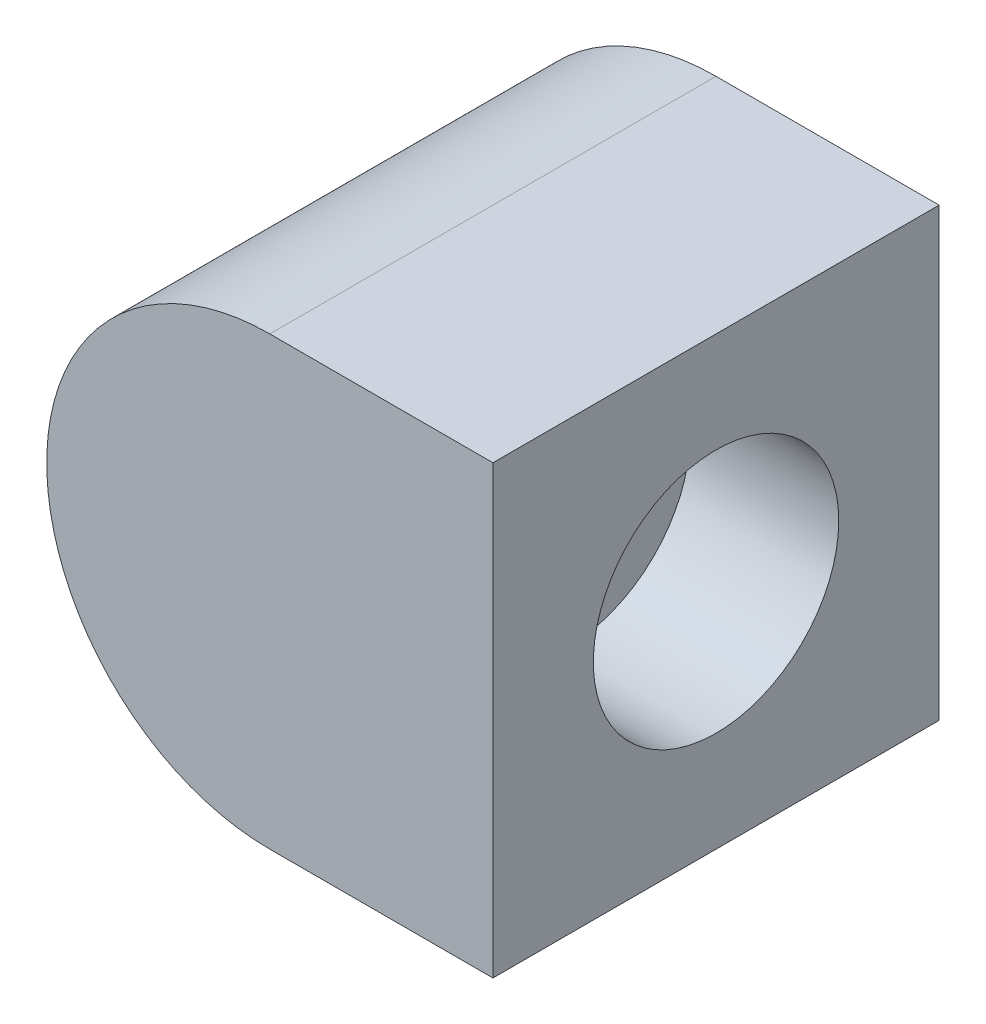
ISO-10303-21;
HEADER;
FILE_DESCRIPTION(('STEP AP214'),'2;1');
FILE_NAME('part.step','',(''),(''),'','','');
FILE_SCHEMA(('AUTOMOTIVE_DESIGN { 1 0 10303 214 1 1 1 1 }'));
ENDSEC;
DATA;
#1=APPLICATION_CONTEXT('core data for automotive mechanical design processes');
#2=APPLICATION_PROTOCOL_DEFINITION('international standard','automotive_design',2000,#1);
#3=PRODUCT_CONTEXT('',#1,'mechanical');
#4=PRODUCT('Part','Part','',(#3));
#5=PRODUCT_RELATED_PRODUCT_CATEGORY('part','',(#4));
#6=PRODUCT_DEFINITION_FORMATION('','',#4);
#7=PRODUCT_DEFINITION_CONTEXT('part definition',#1,'design');
#8=PRODUCT_DEFINITION('design','',#6,#7);
#9=PRODUCT_DEFINITION_SHAPE('','',#8);
#10=(LENGTH_UNIT() NAMED_UNIT(*) SI_UNIT(.MILLI.,.METRE.));
#11=(NAMED_UNIT(*) PLANE_ANGLE_UNIT() SI_UNIT($,.RADIAN.));
#12=(NAMED_UNIT(*) SI_UNIT($,.STERADIAN.) SOLID_ANGLE_UNIT());
#13=UNCERTAINTY_MEASURE_WITH_UNIT(LENGTH_MEASURE(1.E-05),#10,'distance_accuracy_value','');
#14=(GEOMETRIC_REPRESENTATION_CONTEXT(3) GLOBAL_UNCERTAINTY_ASSIGNED_CONTEXT((#13)) GLOBAL_UNIT_ASSIGNED_CONTEXT((#10,
#11,#12)) REPRESENTATION_CONTEXT('',''));
#15=CARTESIAN_POINT('',(0.,0.,0.));
#16=DIRECTION('',(0.,0.,1.));
#17=DIRECTION('',(1.,0.,0.));
#18=AXIS2_PLACEMENT_3D('',#15,#16,#17);
#19=CARTESIAN_POINT('',(0.,0.,6.));
#20=DIRECTION('',(0.,0.,-1.));
#21=DIRECTION('',(-1.,0.,0.));
#22=AXIS2_PLACEMENT_3D('',#19,#20,#21);
#23=CYLINDRICAL_SURFACE('',#22,3.);
#24=CARTESIAN_POINT('',(0.,0.,0.));
#25=DIRECTION('',(0.,0.,1.));
#26=DIRECTION('',(1.,0.,0.));
#27=AXIS2_PLACEMENT_3D('',#24,#25,#26);
#28=CIRCLE('',#27,3.);
#29=CARTESIAN_POINT('',(0.,3.,0.));
#30=VERTEX_POINT('',#29);
#31=CARTESIAN_POINT('',(0.,-3.,0.));
#32=VERTEX_POINT('',#31);
#33=EDGE_CURVE('E96',#30,#32,#28,.T.);
#34=ORIENTED_EDGE('',*,*,#33,.T.);
#35=DIRECTION('',(0.,0.,-1.));
#36=VECTOR('',#35,1.);
#37=CARTESIAN_POINT('',(0.,-3.,6.));
#38=LINE('',#37,#36);
#39=CARTESIAN_POINT('',(0.,-3.,6.));
#40=VERTEX_POINT('',#39);
#41=EDGE_CURVE('E11',#40,#32,#38,.T.);
#42=ORIENTED_EDGE('',*,*,#41,.F.);
#43=CARTESIAN_POINT('',(0.,0.,6.));
#44=DIRECTION('',(0.,0.,1.));
#45=DIRECTION('',(1.,0.,0.));
#46=AXIS2_PLACEMENT_3D('',#43,#44,#45);
#47=CIRCLE('',#46,3.);
#48=CARTESIAN_POINT('',(0.,3.,6.));
#49=VERTEX_POINT('',#48);
#50=EDGE_CURVE('E84',#49,#40,#47,.T.);
#51=ORIENTED_EDGE('',*,*,#50,.F.);
#52=DIRECTION('',(0.,0.,-1.));
#53=VECTOR('',#52,1.);
#54=CARTESIAN_POINT('',(0.,3.,6.));
#55=LINE('',#54,#53);
#56=EDGE_CURVE('E92',#49,#30,#55,.T.);
#57=ORIENTED_EDGE('',*,*,#56,.T.);
#58=EDGE_LOOP('',(#34,#42,#51,#57));
#59=FACE_BOUND('',#58,.T.);
#60=ADVANCED_FACE('F33',(#59),#23,.T.);
#61=CARTESIAN_POINT('',(3.,-3.,6.));
#62=DIRECTION('',(0.,1.,0.));
#63=DIRECTION('',(-1.,0.,0.));
#64=AXIS2_PLACEMENT_3D('',#61,#62,#63);
#65=PLANE('',#64);
#66=DIRECTION('',(1.,0.,0.));
#67=VECTOR('',#66,1.);
#68=CARTESIAN_POINT('',(3.,-3.,0.));
#69=LINE('',#68,#67);
#70=CARTESIAN_POINT('',(3.,-3.,0.));
#71=VERTEX_POINT('',#70);
#72=EDGE_CURVE('E88',#32,#71,#69,.T.);
#73=ORIENTED_EDGE('',*,*,#72,.T.);
#74=DIRECTION('',(0.,0.,-1.));
#75=VECTOR('',#74,1.);
#76=CARTESIAN_POINT('',(3.,-3.,6.));
#77=LINE('',#76,#75);
#78=CARTESIAN_POINT('',(3.,-3.,6.));
#79=VERTEX_POINT('',#78);
#80=EDGE_CURVE('E41',#79,#71,#77,.T.);
#81=ORIENTED_EDGE('',*,*,#80,.F.);
#82=DIRECTION('',(1.,0.,0.));
#83=VECTOR('',#82,1.);
#84=CARTESIAN_POINT('',(3.,-3.,6.));
#85=LINE('',#84,#83);
#86=EDGE_CURVE('E79',#40,#79,#85,.T.);
#87=ORIENTED_EDGE('',*,*,#86,.F.);
#88=ORIENTED_EDGE('',*,*,#41,.T.);
#89=EDGE_LOOP('',(#73,#81,#87,#88));
#90=FACE_BOUND('',#89,.T.);
#91=ADVANCED_FACE('F87',(#90),#65,.F.);
#92=CARTESIAN_POINT('',(3.,3.,6.));
#93=DIRECTION('',(-1.,0.,0.));
#94=DIRECTION('',(0.,0.,1.));
#95=AXIS2_PLACEMENT_3D('',#92,#93,#94);
#96=PLANE('',#95);
#97=CARTESIAN_POINT('',(3.,0.,3.));
#98=DIRECTION('',(1.,0.,0.));
#99=DIRECTION('',(0.,0.,-1.));
#100=AXIS2_PLACEMENT_3D('',#97,#98,#99);
#101=CIRCLE('',#100,1.65);
#102=CARTESIAN_POINT('',(3.,0.,1.35));
#103=VERTEX_POINT('',#102);
#104=EDGE_CURVE('E110',#103,#103,#101,.T.);
#105=ORIENTED_EDGE('',*,*,#104,.F.);
#106=EDGE_LOOP('',(#105));
#107=FACE_BOUND('',#106,.T.);
#108=DIRECTION('',(0.,1.,0.));
#109=VECTOR('',#108,1.);
#110=CARTESIAN_POINT('',(3.,3.,0.));
#111=LINE('',#110,#109);
#112=CARTESIAN_POINT('',(3.,3.,0.));
#113=VERTEX_POINT('',#112);
#114=EDGE_CURVE('E66',#71,#113,#111,.T.);
#115=ORIENTED_EDGE('',*,*,#114,.T.);
#116=DIRECTION('',(0.,0.,-1.));
#117=VECTOR('',#116,1.);
#118=CARTESIAN_POINT('',(3.,3.,6.));
#119=LINE('',#118,#117);
#120=CARTESIAN_POINT('',(3.,3.,6.));
#121=VERTEX_POINT('',#120);
#122=EDGE_CURVE('E89',#121,#113,#119,.T.);
#123=ORIENTED_EDGE('',*,*,#122,.F.);
#124=DIRECTION('',(0.,1.,0.));
#125=VECTOR('',#124,1.);
#126=CARTESIAN_POINT('',(3.,3.,6.));
#127=LINE('',#126,#125);
#128=EDGE_CURVE('E82',#79,#121,#127,.T.);
#129=ORIENTED_EDGE('',*,*,#128,.F.);
#130=ORIENTED_EDGE('',*,*,#80,.T.);
#131=EDGE_LOOP('',(#115,#123,#129,#130));
#132=FACE_BOUND('',#131,.T.);
#133=ADVANCED_FACE('F90',(#107,#132),#96,.F.);
#134=CARTESIAN_POINT('',(0.,3.,6.));
#135=DIRECTION('',(0.,-1.,0.));
#136=DIRECTION('',(1.,0.,0.));
#137=AXIS2_PLACEMENT_3D('',#134,#135,#136);
#138=PLANE('',#137);
#139=DIRECTION('',(-1.,0.,0.));
#140=VECTOR('',#139,1.);
#141=CARTESIAN_POINT('',(0.,3.,0.));
#142=LINE('',#141,#140);
#143=EDGE_CURVE('E72',#113,#30,#142,.T.);
#144=ORIENTED_EDGE('',*,*,#143,.T.);
#145=ORIENTED_EDGE('',*,*,#56,.F.);
#146=DIRECTION('',(-1.,0.,0.));
#147=VECTOR('',#146,1.);
#148=CARTESIAN_POINT('',(0.,3.,6.));
#149=LINE('',#148,#147);
#150=EDGE_CURVE('E49',#121,#49,#149,.T.);
#151=ORIENTED_EDGE('',*,*,#150,.F.);
#152=ORIENTED_EDGE('',*,*,#122,.T.);
#153=EDGE_LOOP('',(#144,#145,#151,#152));
#154=FACE_BOUND('',#153,.T.);
#155=ADVANCED_FACE('F104',(#154),#138,.F.);
#156=CARTESIAN_POINT('',(0.,0.,6.));
#157=DIRECTION('',(0.,0.,1.));
#158=DIRECTION('',(1.,0.,0.));
#159=AXIS2_PLACEMENT_3D('',#156,#157,#158);
#160=PLANE('',#159);
#161=ORIENTED_EDGE('',*,*,#50,.T.);
#162=ORIENTED_EDGE('',*,*,#86,.T.);
#163=ORIENTED_EDGE('',*,*,#128,.T.);
#164=ORIENTED_EDGE('',*,*,#150,.T.);
#165=EDGE_LOOP('',(#161,#162,#163,#164));
#166=FACE_BOUND('',#165,.T.);
#167=ADVANCED_FACE('F80',(#166),#160,.T.);
#168=CARTESIAN_POINT('',(0.,0.,0.));
#169=DIRECTION('',(0.,0.,1.));
#170=DIRECTION('',(1.,0.,0.));
#171=AXIS2_PLACEMENT_3D('',#168,#169,#170);
#172=PLANE('',#171);
#173=ORIENTED_EDGE('',*,*,#33,.F.);
#174=ORIENTED_EDGE('',*,*,#143,.F.);
#175=ORIENTED_EDGE('',*,*,#114,.F.);
#176=ORIENTED_EDGE('',*,*,#72,.F.);
#177=EDGE_LOOP('',(#173,#174,#175,#176));
#178=FACE_BOUND('',#177,.T.);
#179=ADVANCED_FACE('F107',(#178),#172,.F.);
#180=CARTESIAN_POINT('',(1.,0.,3.));
#181=DIRECTION('',(1.,0.,0.));
#182=DIRECTION('',(0.,0.,-1.));
#183=AXIS2_PLACEMENT_3D('',#180,#181,#182);
#184=CYLINDRICAL_SURFACE('',#183,1.65);
#185=CARTESIAN_POINT('',(1.,0.,3.));
#186=DIRECTION('',(1.,0.,0.));
#187=DIRECTION('',(0.,0.,-1.));
#188=AXIS2_PLACEMENT_3D('',#185,#186,#187);
#189=CIRCLE('',#188,1.65);
#190=CARTESIAN_POINT('',(1.,0.,1.35));
#191=VERTEX_POINT('',#190);
#192=EDGE_CURVE('E99',#191,#191,#189,.T.);
#193=ORIENTED_EDGE('',*,*,#192,.F.);
#194=EDGE_LOOP('',(#193));
#195=FACE_BOUND('',#194,.T.);
#196=ORIENTED_EDGE('',*,*,#104,.T.);
#197=EDGE_LOOP('',(#196));
#198=FACE_BOUND('',#197,.T.);
#199=ADVANCED_FACE('F118',(#195,#198),#184,.F.);
#200=CARTESIAN_POINT('',(1.,0.,3.));
#201=DIRECTION('',(1.,0.,0.));
#202=DIRECTION('',(0.,0.,-1.));
#203=AXIS2_PLACEMENT_3D('',#200,#201,#202);
#204=PLANE('',#203);
#205=ORIENTED_EDGE('',*,*,#192,.T.);
#206=EDGE_LOOP('',(#205));
#207=FACE_BOUND('',#206,.T.);
#208=ADVANCED_FACE('F116',(#207),#204,.T.);
#209=CLOSED_SHELL('',(#60,#91,#133,#155,#167,#179,#199,#208));
#210=MANIFOLD_SOLID_BREP('B2',#209);
#211=ADVANCED_BREP_SHAPE_REPRESENTATION('',(#18,#210),#14);
#212=SHAPE_DEFINITION_REPRESENTATION(#9,#211);
ENDSEC;
END-ISO-10303-21;
